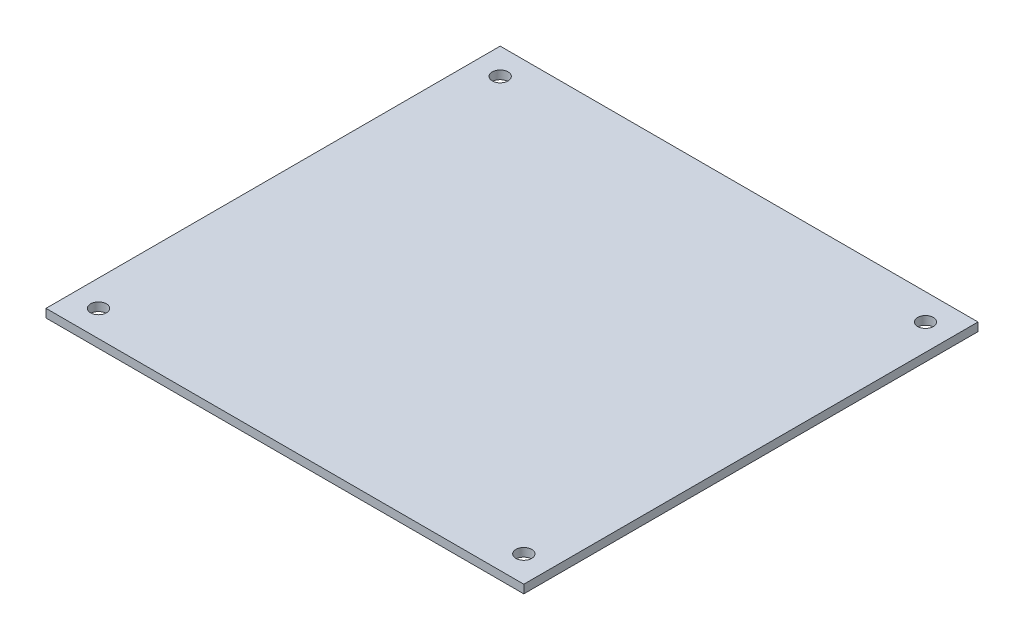
ISO-10303-21;
HEADER;
FILE_DESCRIPTION(('STEP AP214'),'2;1');
FILE_NAME('part.step','',(''),(''),'','','');
FILE_SCHEMA(('AUTOMOTIVE_DESIGN { 1 0 10303 214 1 1 1 1 }'));
ENDSEC;
DATA;
#1=APPLICATION_CONTEXT('core data for automotive mechanical design processes');
#2=APPLICATION_PROTOCOL_DEFINITION('international standard','automotive_design',2000,#1);
#3=PRODUCT_CONTEXT('',#1,'mechanical');
#4=PRODUCT('Part','Part','',(#3));
#5=PRODUCT_RELATED_PRODUCT_CATEGORY('part','',(#4));
#6=PRODUCT_DEFINITION_FORMATION('','',#4);
#7=PRODUCT_DEFINITION_CONTEXT('part definition',#1,'design');
#8=PRODUCT_DEFINITION('design','',#6,#7);
#9=PRODUCT_DEFINITION_SHAPE('','',#8);
#10=(LENGTH_UNIT() NAMED_UNIT(*) SI_UNIT(.MILLI.,.METRE.));
#11=(NAMED_UNIT(*) PLANE_ANGLE_UNIT() SI_UNIT($,.RADIAN.));
#12=(NAMED_UNIT(*) SI_UNIT($,.STERADIAN.) SOLID_ANGLE_UNIT());
#13=UNCERTAINTY_MEASURE_WITH_UNIT(LENGTH_MEASURE(1.E-05),#10,'distance_accuracy_value','');
#14=(GEOMETRIC_REPRESENTATION_CONTEXT(3) GLOBAL_UNCERTAINTY_ASSIGNED_CONTEXT((#13)) GLOBAL_UNIT_ASSIGNED_CONTEXT((#10,
#11,#12)) REPRESENTATION_CONTEXT('',''));
#15=CARTESIAN_POINT('',(0.,0.,0.));
#16=DIRECTION('',(0.,0.,1.));
#17=DIRECTION('',(1.,0.,0.));
#18=AXIS2_PLACEMENT_3D('',#15,#16,#17);
#19=CARTESIAN_POINT('',(91.,1.6,0.));
#20=DIRECTION('',(0.,0.,-1.));
#21=DIRECTION('',(-1.,0.,0.));
#22=AXIS2_PLACEMENT_3D('',#19,#20,#21);
#23=PLANE('',#22);
#24=DIRECTION('',(1.,0.,0.));
#25=VECTOR('',#24,1.);
#26=CARTESIAN_POINT('',(91.,0.,0.));
#27=LINE('',#26,#25);
#28=CARTESIAN_POINT('',(0.,0.,0.));
#29=VERTEX_POINT('',#28);
#30=CARTESIAN_POINT('',(91.,0.,0.));
#31=VERTEX_POINT('',#30);
#32=EDGE_CURVE('E109',#29,#31,#27,.T.);
#33=ORIENTED_EDGE('',*,*,#32,.T.);
#34=DIRECTION('',(0.,-1.,0.));
#35=VECTOR('',#34,1.);
#36=CARTESIAN_POINT('',(91.,1.6,0.));
#37=LINE('',#36,#35);
#38=CARTESIAN_POINT('',(91.,1.6,0.));
#39=VERTEX_POINT('',#38);
#40=EDGE_CURVE('E11',#39,#31,#37,.T.);
#41=ORIENTED_EDGE('',*,*,#40,.F.);
#42=DIRECTION('',(1.,0.,0.));
#43=VECTOR('',#42,1.);
#44=CARTESIAN_POINT('',(91.,1.6,0.));
#45=LINE('',#44,#43);
#46=CARTESIAN_POINT('',(0.,1.6,0.));
#47=VERTEX_POINT('',#46);
#48=EDGE_CURVE('E92',#47,#39,#45,.T.);
#49=ORIENTED_EDGE('',*,*,#48,.F.);
#50=DIRECTION('',(0.,-1.,0.));
#51=VECTOR('',#50,1.);
#52=CARTESIAN_POINT('',(0.,1.6,0.));
#53=LINE('',#52,#51);
#54=EDGE_CURVE('E105',#47,#29,#53,.T.);
#55=ORIENTED_EDGE('',*,*,#54,.T.);
#56=EDGE_LOOP('',(#33,#41,#49,#55));
#57=FACE_BOUND('',#56,.T.);
#58=ADVANCED_FACE('F38',(#57),#23,.F.);
#59=CARTESIAN_POINT('',(91.,1.6,-86.5));
#60=DIRECTION('',(-1.,0.,0.));
#61=DIRECTION('',(0.,0.,1.));
#62=AXIS2_PLACEMENT_3D('',#59,#60,#61);
#63=PLANE('',#62);
#64=DIRECTION('',(0.,0.,-1.));
#65=VECTOR('',#64,1.);
#66=CARTESIAN_POINT('',(91.,0.,-86.5));
#67=LINE('',#66,#65);
#68=CARTESIAN_POINT('',(91.,0.,-86.5));
#69=VERTEX_POINT('',#68);
#70=EDGE_CURVE('E97',#31,#69,#67,.T.);
#71=ORIENTED_EDGE('',*,*,#70,.T.);
#72=DIRECTION('',(0.,-1.,0.));
#73=VECTOR('',#72,1.);
#74=CARTESIAN_POINT('',(91.,1.6,-86.5));
#75=LINE('',#74,#73);
#76=CARTESIAN_POINT('',(91.,1.6,-86.5));
#77=VERTEX_POINT('',#76);
#78=EDGE_CURVE('E48',#77,#69,#75,.T.);
#79=ORIENTED_EDGE('',*,*,#78,.F.);
#80=DIRECTION('',(0.,0.,-1.));
#81=VECTOR('',#80,1.);
#82=CARTESIAN_POINT('',(91.,1.6,-86.5));
#83=LINE('',#82,#81);
#84=EDGE_CURVE('E87',#39,#77,#83,.T.);
#85=ORIENTED_EDGE('',*,*,#84,.F.);
#86=ORIENTED_EDGE('',*,*,#40,.T.);
#87=EDGE_LOOP('',(#71,#79,#85,#86));
#88=FACE_BOUND('',#87,.T.);
#89=ADVANCED_FACE('F96',(#88),#63,.F.);
#90=CARTESIAN_POINT('',(0.,1.6,-86.5));
#91=DIRECTION('',(0.,0.,1.));
#92=DIRECTION('',(1.,0.,0.));
#93=AXIS2_PLACEMENT_3D('',#90,#91,#92);
#94=PLANE('',#93);
#95=DIRECTION('',(-1.,0.,0.));
#96=VECTOR('',#95,1.);
#97=CARTESIAN_POINT('',(0.,0.,-86.5));
#98=LINE('',#97,#96);
#99=CARTESIAN_POINT('',(0.,0.,-86.5));
#100=VERTEX_POINT('',#99);
#101=EDGE_CURVE('E74',#69,#100,#98,.T.);
#102=ORIENTED_EDGE('',*,*,#101,.T.);
#103=DIRECTION('',(0.,-1.,0.));
#104=VECTOR('',#103,1.);
#105=CARTESIAN_POINT('',(0.,1.6,-86.5));
#106=LINE('',#105,#104);
#107=CARTESIAN_POINT('',(0.,1.6,-86.5));
#108=VERTEX_POINT('',#107);
#109=EDGE_CURVE('E99',#108,#100,#106,.T.);
#110=ORIENTED_EDGE('',*,*,#109,.F.);
#111=DIRECTION('',(-1.,0.,0.));
#112=VECTOR('',#111,1.);
#113=CARTESIAN_POINT('',(0.,1.6,-86.5));
#114=LINE('',#113,#112);
#115=EDGE_CURVE('E90',#77,#108,#114,.T.);
#116=ORIENTED_EDGE('',*,*,#115,.F.);
#117=ORIENTED_EDGE('',*,*,#78,.T.);
#118=EDGE_LOOP('',(#102,#110,#116,#117));
#119=FACE_BOUND('',#118,.T.);
#120=ADVANCED_FACE('F101',(#119),#94,.F.);
#121=CARTESIAN_POINT('',(0.,1.6,0.));
#122=DIRECTION('',(1.,0.,0.));
#123=DIRECTION('',(0.,0.,-1.));
#124=AXIS2_PLACEMENT_3D('',#121,#122,#123);
#125=PLANE('',#124);
#126=DIRECTION('',(0.,0.,1.));
#127=VECTOR('',#126,1.);
#128=CARTESIAN_POINT('',(0.,0.,0.));
#129=LINE('',#128,#127);
#130=EDGE_CURVE('E80',#100,#29,#129,.T.);
#131=ORIENTED_EDGE('',*,*,#130,.T.);
#132=ORIENTED_EDGE('',*,*,#54,.F.);
#133=DIRECTION('',(0.,0.,1.));
#134=VECTOR('',#133,1.);
#135=CARTESIAN_POINT('',(0.,1.6,0.));
#136=LINE('',#135,#134);
#137=EDGE_CURVE('E57',#108,#47,#136,.T.);
#138=ORIENTED_EDGE('',*,*,#137,.F.);
#139=ORIENTED_EDGE('',*,*,#109,.T.);
#140=EDGE_LOOP('',(#131,#132,#138,#139));
#141=FACE_BOUND('',#140,.T.);
#142=ADVANCED_FACE('F155',(#141),#125,.F.);
#143=CARTESIAN_POINT('',(0.,1.6,0.));
#144=DIRECTION('',(0.,-1.,0.));
#145=DIRECTION('',(0.,0.,-1.));
#146=AXIS2_PLACEMENT_3D('',#143,#144,#145);
#147=PLANE('',#146);
#148=CARTESIAN_POINT('',(86.,1.6,-81.5));
#149=DIRECTION('',(0.,1.,0.));
#150=DIRECTION('',(0.,0.,1.));
#151=AXIS2_PLACEMENT_3D('',#148,#149,#150);
#152=CIRCLE('',#151,1.5);
#153=CARTESIAN_POINT('',(86.,1.6,-80.));
#154=VERTEX_POINT('',#153);
#155=EDGE_CURVE('E234',#154,#154,#152,.T.);
#156=ORIENTED_EDGE('',*,*,#155,.F.);
#157=EDGE_LOOP('',(#156));
#158=FACE_BOUND('',#157,.T.);
#159=CARTESIAN_POINT('',(5.,1.6,-81.5));
#160=DIRECTION('',(0.,1.,0.));
#161=DIRECTION('',(0.,0.,1.));
#162=AXIS2_PLACEMENT_3D('',#159,#160,#161);
#163=CIRCLE('',#162,1.5);
#164=CARTESIAN_POINT('',(5.,1.6,-80.));
#165=VERTEX_POINT('',#164);
#166=EDGE_CURVE('E230',#165,#165,#163,.T.);
#167=ORIENTED_EDGE('',*,*,#166,.F.);
#168=EDGE_LOOP('',(#167));
#169=FACE_BOUND('',#168,.T.);
#170=CARTESIAN_POINT('',(5.,1.6,-5.));
#171=DIRECTION('',(0.,1.,0.));
#172=DIRECTION('',(0.,0.,1.));
#173=AXIS2_PLACEMENT_3D('',#170,#171,#172);
#174=CIRCLE('',#173,1.5);
#175=CARTESIAN_POINT('',(5.,1.6,-3.5));
#176=VERTEX_POINT('',#175);
#177=EDGE_CURVE('E233',#176,#176,#174,.T.);
#178=ORIENTED_EDGE('',*,*,#177,.F.);
#179=EDGE_LOOP('',(#178));
#180=FACE_BOUND('',#179,.T.);
#181=CARTESIAN_POINT('',(86.,1.6,-5.));
#182=DIRECTION('',(0.,1.,0.));
#183=DIRECTION('',(0.,0.,1.));
#184=AXIS2_PLACEMENT_3D('',#181,#182,#183);
#185=CIRCLE('',#184,1.5);
#186=CARTESIAN_POINT('',(86.,1.6,-3.50000000000001));
#187=VERTEX_POINT('',#186);
#188=EDGE_CURVE('E128',#187,#187,#185,.T.);
#189=ORIENTED_EDGE('',*,*,#188,.F.);
#190=EDGE_LOOP('',(#189));
#191=FACE_BOUND('',#190,.T.);
#192=ORIENTED_EDGE('',*,*,#48,.T.);
#193=ORIENTED_EDGE('',*,*,#84,.T.);
#194=ORIENTED_EDGE('',*,*,#115,.T.);
#195=ORIENTED_EDGE('',*,*,#137,.T.);
#196=EDGE_LOOP('',(#192,#193,#194,#195));
#197=FACE_BOUND('',#196,.T.);
#198=ADVANCED_FACE('F88',(#158,#169,#180,#191,#197),#147,.F.);
#199=CARTESIAN_POINT('',(0.,0.,0.));
#200=DIRECTION('',(0.,-1.,0.));
#201=DIRECTION('',(0.,0.,-1.));
#202=AXIS2_PLACEMENT_3D('',#199,#200,#201);
#203=PLANE('',#202);
#204=CARTESIAN_POINT('',(86.,0.,-81.5));
#205=DIRECTION('',(0.,-1.,0.));
#206=DIRECTION('',(0.,0.,-1.));
#207=AXIS2_PLACEMENT_3D('',#204,#205,#206);
#208=CIRCLE('',#207,1.5);
#209=CARTESIAN_POINT('',(86.,0.,-83.));
#210=VERTEX_POINT('',#209);
#211=EDGE_CURVE('E41',#210,#210,#208,.T.);
#212=ORIENTED_EDGE('',*,*,#211,.F.);
#213=EDGE_LOOP('',(#212));
#214=FACE_BOUND('',#213,.T.);
#215=CARTESIAN_POINT('',(5.,0.,-81.5));
#216=DIRECTION('',(0.,-1.,0.));
#217=DIRECTION('',(0.,0.,-1.));
#218=AXIS2_PLACEMENT_3D('',#215,#216,#217);
#219=CIRCLE('',#218,1.5);
#220=CARTESIAN_POINT('',(5.,0.,-83.));
#221=VERTEX_POINT('',#220);
#222=EDGE_CURVE('E131',#221,#221,#219,.T.);
#223=ORIENTED_EDGE('',*,*,#222,.F.);
#224=EDGE_LOOP('',(#223));
#225=FACE_BOUND('',#224,.T.);
#226=CARTESIAN_POINT('',(5.,0.,-5.));
#227=DIRECTION('',(0.,-1.,0.));
#228=DIRECTION('',(0.,0.,-1.));
#229=AXIS2_PLACEMENT_3D('',#226,#227,#228);
#230=CIRCLE('',#229,1.5);
#231=CARTESIAN_POINT('',(5.,0.,-6.5));
#232=VERTEX_POINT('',#231);
#233=EDGE_CURVE('E127',#232,#232,#230,.T.);
#234=ORIENTED_EDGE('',*,*,#233,.F.);
#235=EDGE_LOOP('',(#234));
#236=FACE_BOUND('',#235,.T.);
#237=CARTESIAN_POINT('',(86.,0.,-5.));
#238=DIRECTION('',(0.,-1.,0.));
#239=DIRECTION('',(0.,0.,-1.));
#240=AXIS2_PLACEMENT_3D('',#237,#238,#239);
#241=CIRCLE('',#240,1.5);
#242=CARTESIAN_POINT('',(86.,0.,-6.5));
#243=VERTEX_POINT('',#242);
#244=EDGE_CURVE('E123',#243,#243,#241,.T.);
#245=ORIENTED_EDGE('',*,*,#244,.F.);
#246=EDGE_LOOP('',(#245));
#247=FACE_BOUND('',#246,.T.);
#248=ORIENTED_EDGE('',*,*,#32,.F.);
#249=ORIENTED_EDGE('',*,*,#130,.F.);
#250=ORIENTED_EDGE('',*,*,#101,.F.);
#251=ORIENTED_EDGE('',*,*,#70,.F.);
#252=EDGE_LOOP('',(#248,#249,#250,#251));
#253=FACE_BOUND('',#252,.T.);
#254=ADVANCED_FACE('F143',(#214,#225,#236,#247,#253),#203,.T.);
#255=CARTESIAN_POINT('',(86.,-8.4,-5.));
#256=DIRECTION('',(0.,1.,0.));
#257=DIRECTION('',(0.,0.,1.));
#258=AXIS2_PLACEMENT_3D('',#255,#256,#257);
#259=CYLINDRICAL_SURFACE('',#258,1.5);
#260=ORIENTED_EDGE('',*,*,#244,.T.);
#261=EDGE_LOOP('',(#260));
#262=FACE_BOUND('',#261,.T.);
#263=ORIENTED_EDGE('',*,*,#188,.T.);
#264=EDGE_LOOP('',(#263));
#265=FACE_BOUND('',#264,.T.);
#266=ADVANCED_FACE('F146',(#262,#265),#259,.F.);
#267=CARTESIAN_POINT('',(5.,-8.4,-5.));
#268=DIRECTION('',(0.,1.,0.));
#269=DIRECTION('',(0.,0.,1.));
#270=AXIS2_PLACEMENT_3D('',#267,#268,#269);
#271=CYLINDRICAL_SURFACE('',#270,1.5);
#272=ORIENTED_EDGE('',*,*,#233,.T.);
#273=EDGE_LOOP('',(#272));
#274=FACE_BOUND('',#273,.T.);
#275=ORIENTED_EDGE('',*,*,#177,.T.);
#276=EDGE_LOOP('',(#275));
#277=FACE_BOUND('',#276,.T.);
#278=ADVANCED_FACE('F196',(#274,#277),#271,.F.);
#279=CARTESIAN_POINT('',(5.,-8.4,-81.5));
#280=DIRECTION('',(0.,1.,0.));
#281=DIRECTION('',(0.,0.,1.));
#282=AXIS2_PLACEMENT_3D('',#279,#280,#281);
#283=CYLINDRICAL_SURFACE('',#282,1.5);
#284=ORIENTED_EDGE('',*,*,#222,.T.);
#285=EDGE_LOOP('',(#284));
#286=FACE_BOUND('',#285,.T.);
#287=ORIENTED_EDGE('',*,*,#166,.T.);
#288=EDGE_LOOP('',(#287));
#289=FACE_BOUND('',#288,.T.);
#290=ADVANCED_FACE('F206',(#286,#289),#283,.F.);
#291=CARTESIAN_POINT('',(86.,-8.4,-81.5));
#292=DIRECTION('',(0.,1.,0.));
#293=DIRECTION('',(0.,0.,1.));
#294=AXIS2_PLACEMENT_3D('',#291,#292,#293);
#295=CYLINDRICAL_SURFACE('',#294,1.5);
#296=ORIENTED_EDGE('',*,*,#211,.T.);
#297=EDGE_LOOP('',(#296));
#298=FACE_BOUND('',#297,.T.);
#299=ORIENTED_EDGE('',*,*,#155,.T.);
#300=EDGE_LOOP('',(#299));
#301=FACE_BOUND('',#300,.T.);
#302=ADVANCED_FACE('F140',(#298,#301),#295,.F.);
#303=CLOSED_SHELL('',(#58,#89,#120,#142,#198,#254,#266,#278,#290,#302));
#304=MANIFOLD_SOLID_BREP('B2',#303);
#305=ADVANCED_BREP_SHAPE_REPRESENTATION('',(#18,#304),#14);
#306=SHAPE_DEFINITION_REPRESENTATION(#9,#305);
ENDSEC;
END-ISO-10303-21;
